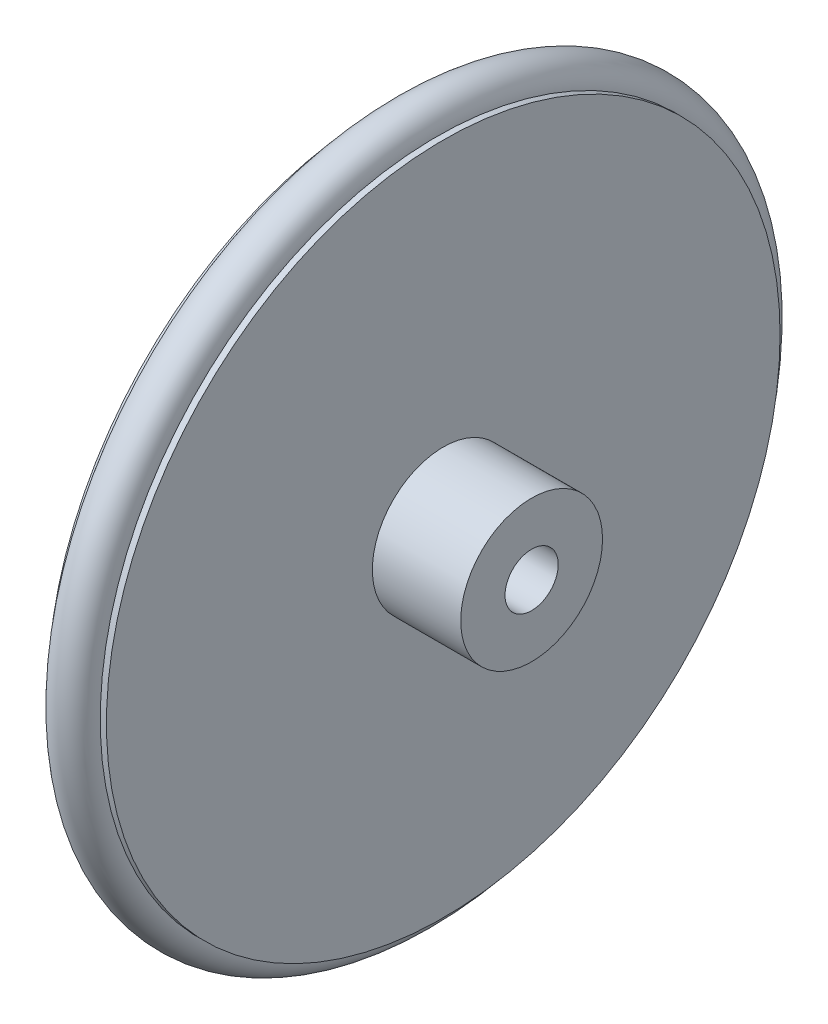
ISO-10303-21;
HEADER;
FILE_DESCRIPTION(('STEP AP214'),'2;1');
FILE_NAME('part.step','',(''),(''),'','','');
FILE_SCHEMA(('AUTOMOTIVE_DESIGN { 1 0 10303 214 1 1 1 1 }'));
ENDSEC;
DATA;
#1=APPLICATION_CONTEXT('core data for automotive mechanical design processes');
#2=APPLICATION_PROTOCOL_DEFINITION('international standard','automotive_design',2000,#1);
#3=PRODUCT_CONTEXT('',#1,'mechanical');
#4=PRODUCT('Part','Part','',(#3));
#5=PRODUCT_RELATED_PRODUCT_CATEGORY('part','',(#4));
#6=PRODUCT_DEFINITION_FORMATION('','',#4);
#7=PRODUCT_DEFINITION_CONTEXT('part definition',#1,'design');
#8=PRODUCT_DEFINITION('design','',#6,#7);
#9=PRODUCT_DEFINITION_SHAPE('','',#8);
#10=(LENGTH_UNIT() NAMED_UNIT(*) SI_UNIT(.MILLI.,.METRE.));
#11=(NAMED_UNIT(*) PLANE_ANGLE_UNIT() SI_UNIT($,.RADIAN.));
#12=(NAMED_UNIT(*) SI_UNIT($,.STERADIAN.) SOLID_ANGLE_UNIT());
#13=UNCERTAINTY_MEASURE_WITH_UNIT(LENGTH_MEASURE(1.E-05),#10,'distance_accuracy_value','');
#14=(GEOMETRIC_REPRESENTATION_CONTEXT(3) GLOBAL_UNCERTAINTY_ASSIGNED_CONTEXT((#13)) GLOBAL_UNIT_ASSIGNED_CONTEXT((#10,
#11,#12)) REPRESENTATION_CONTEXT('',''));
#15=CARTESIAN_POINT('',(0.,0.,0.));
#16=DIRECTION('',(0.,0.,1.));
#17=DIRECTION('',(1.,0.,0.));
#18=AXIS2_PLACEMENT_3D('',#15,#16,#17);
#19=CARTESIAN_POINT('',(3.30000000000003,0.,0.));
#20=DIRECTION('',(-1.,0.,0.));
#21=DIRECTION('',(0.,0.,-1.));
#22=AXIS2_PLACEMENT_3D('',#19,#20,#21);
#23=TOROIDAL_SURFACE('',#22,38.,2.5);
#24=CARTESIAN_POINT('',(3.30000000000003,38.,0.));
#25=DIRECTION('',(0.,0.,1.));
#26=DIRECTION('',(1.,0.,0.));
#27=AXIS2_PLACEMENT_3D('',#24,#25,#26);
#28=CIRCLE('',#27,2.5);
#29=CARTESIAN_POINT('',(3.30000000000003,40.5,0.));
#30=VERTEX_POINT('',#29);
#31=EDGE_CURVE('E11',#30,#30,#28,.T.);
#32=CARTESIAN_POINT('',(3.30000000000003,0.,0.));
#33=DIRECTION('',(-1.,0.,0.));
#34=DIRECTION('',(0.,0.,-1.));
#35=AXIS2_PLACEMENT_3D('',#32,#33,#34);
#36=CIRCLE('',#35,40.5);
#37=EDGE_CURVE('',#30,#30,#36,.T.);
#38=ORIENTED_EDGE('',*,*,#31,.F.);
#39=ORIENTED_EDGE('',*,*,#31,.T.);
#40=ORIENTED_EDGE('',*,*,#37,.T.);
#41=ORIENTED_EDGE('',*,*,#37,.F.);
#42=EDGE_LOOP('',(#38,#40,#39,#41));
#43=FACE_BOUND('',#42,.T.);
#44=ADVANCED_FACE('F45',(#43),#23,.T.);
#45=CLOSED_SHELL('',(#44));
#46=MANIFOLD_SOLID_BREP('B2',#45);
#47=CARTESIAN_POINT('',(0.,38.,0.));
#48=DIRECTION('',(1.,0.,0.));
#49=DIRECTION('',(0.,0.,1.));
#50=AXIS2_PLACEMENT_3D('',#47,#48,#49);
#51=PLANE('',#50);
#52=CARTESIAN_POINT('',(0.,0.,0.));
#53=DIRECTION('',(-1.,0.,0.));
#54=DIRECTION('',(0.,0.,1.));
#55=AXIS2_PLACEMENT_3D('',#52,#53,#54);
#56=CIRCLE('',#55,3.);
#57=CARTESIAN_POINT('',(0.,0.,3.));
#58=VERTEX_POINT('',#57);
#59=EDGE_CURVE('E109',#58,#58,#56,.T.);
#60=ORIENTED_EDGE('',*,*,#59,.F.);
#61=EDGE_LOOP('',(#60));
#62=FACE_BOUND('',#61,.T.);
#63=CARTESIAN_POINT('',(0.,0.,0.));
#64=DIRECTION('',(1.,0.,0.));
#65=DIRECTION('',(0.,0.,-1.));
#66=AXIS2_PLACEMENT_3D('',#63,#64,#65);
#67=CIRCLE('',#66,38.);
#68=CARTESIAN_POINT('',(0.,0.,-38.));
#69=VERTEX_POINT('',#68);
#70=EDGE_CURVE('E106',#69,#69,#67,.T.);
#71=ORIENTED_EDGE('',*,*,#70,.F.);
#72=EDGE_LOOP('',(#71));
#73=FACE_BOUND('',#72,.T.);
#74=ADVANCED_FACE('F78',(#62,#73),#51,.F.);
#75=CARTESIAN_POINT('',(16.57,0.,0.));
#76=DIRECTION('',(-1.,0.,0.));
#77=DIRECTION('',(0.,0.,-1.));
#78=AXIS2_PLACEMENT_3D('',#75,#76,#77);
#79=PLANE('',#78);
#80=CARTESIAN_POINT('',(16.57,0.,0.));
#81=DIRECTION('',(-1.,0.,0.));
#82=DIRECTION('',(0.,0.,1.));
#83=AXIS2_PLACEMENT_3D('',#80,#81,#82);
#84=CIRCLE('',#83,3.);
#85=CARTESIAN_POINT('',(16.57,0.,3.));
#86=VERTEX_POINT('',#85);
#87=EDGE_CURVE('E110',#86,#86,#84,.T.);
#88=ORIENTED_EDGE('',*,*,#87,.T.);
#89=EDGE_LOOP('',(#88));
#90=FACE_BOUND('',#89,.T.);
#91=CARTESIAN_POINT('',(16.57,0.,0.));
#92=DIRECTION('',(1.,0.,0.));
#93=DIRECTION('',(0.,0.,-1.));
#94=AXIS2_PLACEMENT_3D('',#91,#92,#93);
#95=CIRCLE('',#94,8.);
#96=CARTESIAN_POINT('',(16.57,0.,-8.));
#97=VERTEX_POINT('',#96);
#98=EDGE_CURVE('E44',#97,#97,#95,.T.);
#99=ORIENTED_EDGE('',*,*,#98,.T.);
#100=EDGE_LOOP('',(#99));
#101=FACE_BOUND('',#100,.T.);
#102=ADVANCED_FACE('F121',(#90,#101),#79,.F.);
#103=CARTESIAN_POINT('',(-19.9450853035614,0.,0.));
#104=DIRECTION('',(-1.,0.,0.));
#105=DIRECTION('',(0.,0.,-1.));
#106=AXIS2_PLACEMENT_3D('',#103,#104,#105);
#107=CYLINDRICAL_SURFACE('',#106,8.);
#108=CARTESIAN_POINT('',(6.6,0.,0.));
#109=DIRECTION('',(1.,0.,0.));
#110=DIRECTION('',(0.,0.,-1.));
#111=AXIS2_PLACEMENT_3D('',#108,#109,#110);
#112=CIRCLE('',#111,8.);
#113=CARTESIAN_POINT('',(6.6,0.,-8.));
#114=VERTEX_POINT('',#113);
#115=EDGE_CURVE('E84',#114,#114,#112,.T.);
#116=ORIENTED_EDGE('',*,*,#115,.T.);
#117=EDGE_LOOP('',(#116));
#118=FACE_BOUND('',#117,.T.);
#119=ORIENTED_EDGE('',*,*,#98,.F.);
#120=EDGE_LOOP('',(#119));
#121=FACE_BOUND('',#120,.T.);
#122=ADVANCED_FACE('F157',(#118,#121),#107,.T.);
#123=CARTESIAN_POINT('',(6.6,8.,0.));
#124=DIRECTION('',(-1.,0.,0.));
#125=DIRECTION('',(0.,0.,-1.));
#126=AXIS2_PLACEMENT_3D('',#123,#124,#125);
#127=PLANE('',#126);
#128=CARTESIAN_POINT('',(6.6,0.,0.));
#129=DIRECTION('',(1.,0.,0.));
#130=DIRECTION('',(0.,0.,-1.));
#131=AXIS2_PLACEMENT_3D('',#128,#129,#130);
#132=CIRCLE('',#131,38.);
#133=CARTESIAN_POINT('',(6.6,0.,-38.));
#134=VERTEX_POINT('',#133);
#135=EDGE_CURVE('E88',#134,#134,#132,.T.);
#136=ORIENTED_EDGE('',*,*,#135,.T.);
#137=EDGE_LOOP('',(#136));
#138=FACE_BOUND('',#137,.T.);
#139=ORIENTED_EDGE('',*,*,#115,.F.);
#140=EDGE_LOOP('',(#139));
#141=FACE_BOUND('',#140,.T.);
#142=ADVANCED_FACE('F151',(#138,#141),#127,.F.);
#143=CARTESIAN_POINT('',(-19.9450853035614,0.,0.));
#144=DIRECTION('',(-1.,0.,0.));
#145=DIRECTION('',(0.,0.,-1.));
#146=AXIS2_PLACEMENT_3D('',#143,#144,#145);
#147=CYLINDRICAL_SURFACE('',#146,38.);
#148=CARTESIAN_POINT('',(5.9,0.,0.));
#149=DIRECTION('',(1.,0.,0.));
#150=DIRECTION('',(0.,0.,-1.));
#151=AXIS2_PLACEMENT_3D('',#148,#149,#150);
#152=CIRCLE('',#151,38.);
#153=CARTESIAN_POINT('',(5.9,0.,-38.));
#154=VERTEX_POINT('',#153);
#155=EDGE_CURVE('E92',#154,#154,#152,.T.);
#156=ORIENTED_EDGE('',*,*,#155,.T.);
#157=EDGE_LOOP('',(#156));
#158=FACE_BOUND('',#157,.T.);
#159=ORIENTED_EDGE('',*,*,#135,.F.);
#160=EDGE_LOOP('',(#159));
#161=FACE_BOUND('',#160,.T.);
#162=ADVANCED_FACE('F145',(#158,#161),#147,.T.);
#163=CARTESIAN_POINT('',(5.90000000000003,38.,0.));
#164=DIRECTION('',(1.,0.,0.));
#165=DIRECTION('',(0.,0.,1.));
#166=AXIS2_PLACEMENT_3D('',#163,#164,#165);
#167=PLANE('',#166);
#168=CARTESIAN_POINT('',(5.90000000000004,0.,0.));
#169=DIRECTION('',(1.,0.,0.));
#170=DIRECTION('',(0.,0.,-1.));
#171=AXIS2_PLACEMENT_3D('',#168,#169,#170);
#172=CIRCLE('',#171,35.);
#173=CARTESIAN_POINT('',(5.90000000000004,0.,-35.));
#174=VERTEX_POINT('',#173);
#175=EDGE_CURVE('E97',#174,#174,#172,.T.);
#176=ORIENTED_EDGE('',*,*,#175,.T.);
#177=EDGE_LOOP('',(#176));
#178=FACE_BOUND('',#177,.T.);
#179=ORIENTED_EDGE('',*,*,#155,.F.);
#180=EDGE_LOOP('',(#179));
#181=FACE_BOUND('',#180,.T.);
#182=ADVANCED_FACE('F139',(#178,#181),#167,.F.);
#183=CARTESIAN_POINT('',(-19.9450853035614,0.,0.));
#184=DIRECTION('',(-1.,0.,0.));
#185=DIRECTION('',(0.,0.,-1.));
#186=AXIS2_PLACEMENT_3D('',#183,#184,#185);
#187=CYLINDRICAL_SURFACE('',#186,35.);
#188=CARTESIAN_POINT('',(0.700000000000041,0.,0.));
#189=DIRECTION('',(1.,0.,0.));
#190=DIRECTION('',(0.,0.,-1.));
#191=AXIS2_PLACEMENT_3D('',#188,#189,#190);
#192=CIRCLE('',#191,35.);
#193=CARTESIAN_POINT('',(0.700000000000041,0.,-35.));
#194=VERTEX_POINT('',#193);
#195=EDGE_CURVE('E100',#194,#194,#192,.T.);
#196=ORIENTED_EDGE('',*,*,#195,.T.);
#197=EDGE_LOOP('',(#196));
#198=FACE_BOUND('',#197,.T.);
#199=ORIENTED_EDGE('',*,*,#175,.F.);
#200=EDGE_LOOP('',(#199));
#201=FACE_BOUND('',#200,.T.);
#202=ADVANCED_FACE('F133',(#198,#201),#187,.T.);
#203=CARTESIAN_POINT('',(0.700000000000042,35.,0.));
#204=DIRECTION('',(-1.,0.,0.));
#205=DIRECTION('',(0.,0.,-1.));
#206=AXIS2_PLACEMENT_3D('',#203,#204,#205);
#207=PLANE('',#206);
#208=CARTESIAN_POINT('',(0.700000000000041,0.,0.));
#209=DIRECTION('',(1.,0.,0.));
#210=DIRECTION('',(0.,0.,-1.));
#211=AXIS2_PLACEMENT_3D('',#208,#209,#210);
#212=CIRCLE('',#211,38.);
#213=CARTESIAN_POINT('',(0.700000000000041,0.,-38.));
#214=VERTEX_POINT('',#213);
#215=EDGE_CURVE('E103',#214,#214,#212,.T.);
#216=ORIENTED_EDGE('',*,*,#215,.T.);
#217=EDGE_LOOP('',(#216));
#218=FACE_BOUND('',#217,.T.);
#219=ORIENTED_EDGE('',*,*,#195,.F.);
#220=EDGE_LOOP('',(#219));
#221=FACE_BOUND('',#220,.T.);
#222=ADVANCED_FACE('F127',(#218,#221),#207,.F.);
#223=CARTESIAN_POINT('',(-19.9450853035614,0.,0.));
#224=DIRECTION('',(-1.,0.,0.));
#225=DIRECTION('',(0.,0.,-1.));
#226=AXIS2_PLACEMENT_3D('',#223,#224,#225);
#227=CYLINDRICAL_SURFACE('',#226,38.);
#228=ORIENTED_EDGE('',*,*,#70,.T.);
#229=EDGE_LOOP('',(#228));
#230=FACE_BOUND('',#229,.T.);
#231=ORIENTED_EDGE('',*,*,#215,.F.);
#232=EDGE_LOOP('',(#231));
#233=FACE_BOUND('',#232,.T.);
#234=ADVANCED_FACE('F124',(#230,#233),#227,.T.);
#235=CARTESIAN_POINT('',(0.,0.,0.));
#236=DIRECTION('',(1.,0.,0.));
#237=DIRECTION('',(0.,0.,1.));
#238=AXIS2_PLACEMENT_3D('',#235,#236,#237);
#239=CYLINDRICAL_SURFACE('',#238,3.);
#240=ORIENTED_EDGE('',*,*,#59,.T.);
#241=EDGE_LOOP('',(#240));
#242=FACE_BOUND('',#241,.T.);
#243=ORIENTED_EDGE('',*,*,#87,.F.);
#244=EDGE_LOOP('',(#243));
#245=FACE_BOUND('',#244,.T.);
#246=ADVANCED_FACE('F116',(#242,#245),#239,.F.);
#247=CLOSED_SHELL('',(#74,#102,#122,#142,#162,#182,#202,#222,#234,#246));
#248=MANIFOLD_SOLID_BREP('B6',#247);
#249=ADVANCED_BREP_SHAPE_REPRESENTATION('',(#18,#46,#248),#14);
#250=SHAPE_DEFINITION_REPRESENTATION(#9,#249);
ENDSEC;
END-ISO-10303-21;
